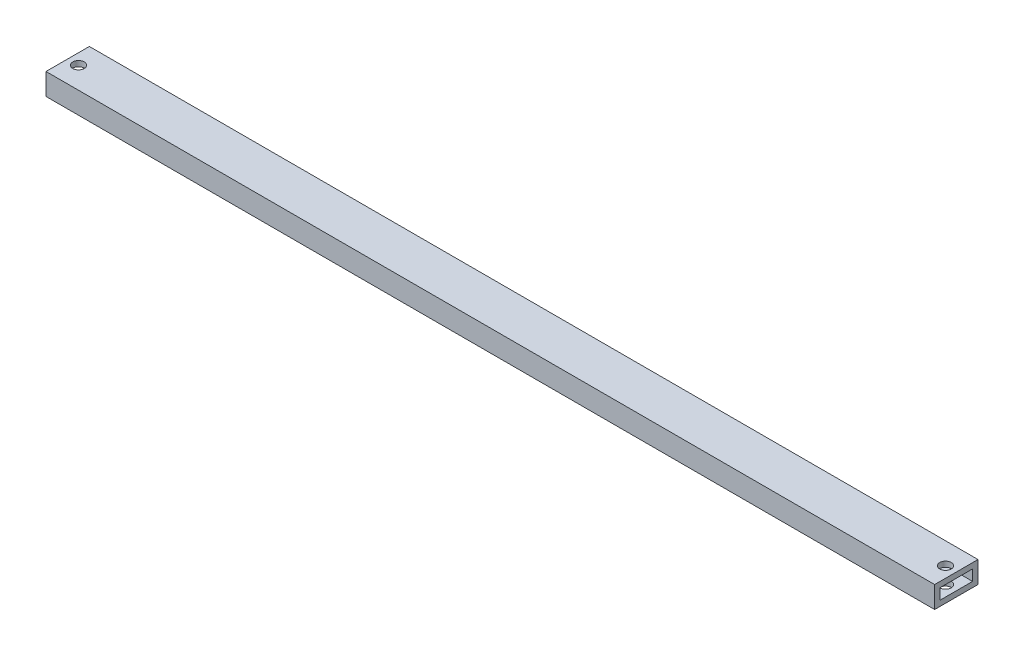
ISO-10303-21;
HEADER;
FILE_DESCRIPTION(('STEP AP214'),'2;1');
FILE_NAME('part.step','',(''),(''),'','','');
FILE_SCHEMA(('AUTOMOTIVE_DESIGN { 1 0 10303 214 1 1 1 1 }'));
ENDSEC;
DATA;
#1=APPLICATION_CONTEXT('core data for automotive mechanical design processes');
#2=APPLICATION_PROTOCOL_DEFINITION('international standard','automotive_design',2000,#1);
#3=PRODUCT_CONTEXT('',#1,'mechanical');
#4=PRODUCT('Part','Part','',(#3));
#5=PRODUCT_RELATED_PRODUCT_CATEGORY('part','',(#4));
#6=PRODUCT_DEFINITION_FORMATION('','',#4);
#7=PRODUCT_DEFINITION_CONTEXT('part definition',#1,'design');
#8=PRODUCT_DEFINITION('design','',#6,#7);
#9=PRODUCT_DEFINITION_SHAPE('','',#8);
#10=(LENGTH_UNIT() NAMED_UNIT(*) SI_UNIT(.MILLI.,.METRE.));
#11=(NAMED_UNIT(*) PLANE_ANGLE_UNIT() SI_UNIT($,.RADIAN.));
#12=(NAMED_UNIT(*) SI_UNIT($,.STERADIAN.) SOLID_ANGLE_UNIT());
#13=UNCERTAINTY_MEASURE_WITH_UNIT(LENGTH_MEASURE(1.E-05),#10,'distance_accuracy_value','');
#14=(GEOMETRIC_REPRESENTATION_CONTEXT(3) GLOBAL_UNCERTAINTY_ASSIGNED_CONTEXT((#13)) GLOBAL_UNIT_ASSIGNED_CONTEXT((#10,
#11,#12)) REPRESENTATION_CONTEXT('',''));
#15=CARTESIAN_POINT('',(0.,0.,0.));
#16=DIRECTION('',(0.,0.,1.));
#17=DIRECTION('',(1.,0.,0.));
#18=AXIS2_PLACEMENT_3D('',#15,#16,#17);
#19=CARTESIAN_POINT('',(520.7,0.,0.));
#20=DIRECTION('',(-1.,0.,0.));
#21=DIRECTION('',(0.,0.,1.));
#22=AXIS2_PLACEMENT_3D('',#19,#20,#21);
#23=PLANE('',#22);
#24=DIRECTION('',(0.,-1.,0.));
#25=VECTOR('',#24,1.);
#26=CARTESIAN_POINT('',(520.7,0.,0.));
#27=LINE('',#26,#25);
#28=CARTESIAN_POINT('',(520.7,12.7,0.));
#29=VERTEX_POINT('',#28);
#30=CARTESIAN_POINT('',(520.7,0.,0.));
#31=VERTEX_POINT('',#30);
#32=EDGE_CURVE('E160',#29,#31,#27,.T.);
#33=ORIENTED_EDGE('',*,*,#32,.T.);
#34=DIRECTION('',(0.,0.,-1.));
#35=VECTOR('',#34,1.);
#36=CARTESIAN_POINT('',(520.7,0.,0.));
#37=LINE('',#36,#35);
#38=CARTESIAN_POINT('',(520.7,0.,-25.4));
#39=VERTEX_POINT('',#38);
#40=EDGE_CURVE('E164',#31,#39,#37,.T.);
#41=ORIENTED_EDGE('',*,*,#40,.T.);
#42=DIRECTION('',(0.,1.,0.));
#43=VECTOR('',#42,1.);
#44=CARTESIAN_POINT('',(520.7,0.,-25.4));
#45=LINE('',#44,#43);
#46=CARTESIAN_POINT('',(520.7,12.7,-25.4));
#47=VERTEX_POINT('',#46);
#48=EDGE_CURVE('E168',#39,#47,#45,.T.);
#49=ORIENTED_EDGE('',*,*,#48,.T.);
#50=DIRECTION('',(0.,0.,1.));
#51=VECTOR('',#50,1.);
#52=CARTESIAN_POINT('',(520.7,12.7,0.));
#53=LINE('',#52,#51);
#54=EDGE_CURVE('E171',#47,#29,#53,.T.);
#55=ORIENTED_EDGE('',*,*,#54,.T.);
#56=EDGE_LOOP('',(#33,#41,#49,#55));
#57=FACE_BOUND('',#56,.T.);
#58=DIRECTION('',(0.,-1.,0.));
#59=VECTOR('',#58,1.);
#60=CARTESIAN_POINT('',(520.7,3.175,-3.175));
#61=LINE('',#60,#59);
#62=CARTESIAN_POINT('',(520.7,9.525,-3.175));
#63=VERTEX_POINT('',#62);
#64=CARTESIAN_POINT('',(520.7,3.175,-3.175));
#65=VERTEX_POINT('',#64);
#66=EDGE_CURVE('E114',#63,#65,#61,.T.);
#67=ORIENTED_EDGE('',*,*,#66,.F.);
#68=DIRECTION('',(0.,0.,1.));
#69=VECTOR('',#68,1.);
#70=CARTESIAN_POINT('',(520.7,9.525,-3.175));
#71=LINE('',#70,#69);
#72=CARTESIAN_POINT('',(520.7,9.525,-22.225));
#73=VERTEX_POINT('',#72);
#74=EDGE_CURVE('E141',#73,#63,#71,.T.);
#75=ORIENTED_EDGE('',*,*,#74,.F.);
#76=DIRECTION('',(0.,1.,0.));
#77=VECTOR('',#76,1.);
#78=CARTESIAN_POINT('',(520.7,3.175,-22.225));
#79=LINE('',#78,#77);
#80=CARTESIAN_POINT('',(520.7,3.175,-22.225));
#81=VERTEX_POINT('',#80);
#82=EDGE_CURVE('E136',#81,#73,#79,.T.);
#83=ORIENTED_EDGE('',*,*,#82,.F.);
#84=DIRECTION('',(0.,0.,-1.));
#85=VECTOR('',#84,1.);
#86=CARTESIAN_POINT('',(520.7,3.175,-3.175));
#87=LINE('',#86,#85);
#88=EDGE_CURVE('E123',#65,#81,#87,.T.);
#89=ORIENTED_EDGE('',*,*,#88,.F.);
#90=EDGE_LOOP('',(#67,#75,#83,#89));
#91=FACE_BOUND('',#90,.T.);
#92=ADVANCED_FACE('F38',(#57,#91),#23,.F.);
#93=CARTESIAN_POINT('',(0.,0.,0.));
#94=DIRECTION('',(-1.,0.,0.));
#95=DIRECTION('',(0.,0.,1.));
#96=AXIS2_PLACEMENT_3D('',#93,#94,#95);
#97=PLANE('',#96);
#98=DIRECTION('',(0.,-1.,0.));
#99=VECTOR('',#98,1.);
#100=CARTESIAN_POINT('',(0.,0.,0.));
#101=LINE('',#100,#99);
#102=CARTESIAN_POINT('',(0.,12.7,0.));
#103=VERTEX_POINT('',#102);
#104=CARTESIAN_POINT('',(0.,0.,0.));
#105=VERTEX_POINT('',#104);
#106=EDGE_CURVE('E132',#103,#105,#101,.T.);
#107=ORIENTED_EDGE('',*,*,#106,.F.);
#108=DIRECTION('',(0.,0.,1.));
#109=VECTOR('',#108,1.);
#110=CARTESIAN_POINT('',(0.,12.7,0.));
#111=LINE('',#110,#109);
#112=CARTESIAN_POINT('',(0.,12.7,-25.4));
#113=VERTEX_POINT('',#112);
#114=EDGE_CURVE('E165',#113,#103,#111,.T.);
#115=ORIENTED_EDGE('',*,*,#114,.F.);
#116=DIRECTION('',(0.,1.,0.));
#117=VECTOR('',#116,1.);
#118=CARTESIAN_POINT('',(0.,0.,-25.4));
#119=LINE('',#118,#117);
#120=CARTESIAN_POINT('',(0.,0.,-25.4));
#121=VERTEX_POINT('',#120);
#122=EDGE_CURVE('E179',#121,#113,#119,.T.);
#123=ORIENTED_EDGE('',*,*,#122,.F.);
#124=DIRECTION('',(0.,0.,-1.));
#125=VECTOR('',#124,1.);
#126=CARTESIAN_POINT('',(0.,0.,0.));
#127=LINE('',#126,#125);
#128=EDGE_CURVE('E177',#105,#121,#127,.T.);
#129=ORIENTED_EDGE('',*,*,#128,.F.);
#130=EDGE_LOOP('',(#107,#115,#123,#129));
#131=FACE_BOUND('',#130,.T.);
#132=DIRECTION('',(0.,0.,1.));
#133=VECTOR('',#132,1.);
#134=CARTESIAN_POINT('',(0.,9.525,-3.175));
#135=LINE('',#134,#133);
#136=CARTESIAN_POINT('',(0.,9.525,-22.225));
#137=VERTEX_POINT('',#136);
#138=CARTESIAN_POINT('',(0.,9.525,-3.175));
#139=VERTEX_POINT('',#138);
#140=EDGE_CURVE('E124',#137,#139,#135,.T.);
#141=ORIENTED_EDGE('',*,*,#140,.T.);
#142=DIRECTION('',(0.,-1.,0.));
#143=VECTOR('',#142,1.);
#144=CARTESIAN_POINT('',(0.,3.175,-3.175));
#145=LINE('',#144,#143);
#146=CARTESIAN_POINT('',(0.,3.175,-3.175));
#147=VERTEX_POINT('',#146);
#148=EDGE_CURVE('E67',#139,#147,#145,.T.);
#149=ORIENTED_EDGE('',*,*,#148,.T.);
#150=DIRECTION('',(0.,0.,-1.));
#151=VECTOR('',#150,1.);
#152=CARTESIAN_POINT('',(0.,3.175,-3.175));
#153=LINE('',#152,#151);
#154=CARTESIAN_POINT('',(0.,3.175,-22.225));
#155=VERTEX_POINT('',#154);
#156=EDGE_CURVE('E130',#147,#155,#153,.T.);
#157=ORIENTED_EDGE('',*,*,#156,.T.);
#158=DIRECTION('',(0.,1.,0.));
#159=VECTOR('',#158,1.);
#160=CARTESIAN_POINT('',(0.,3.175,-22.225));
#161=LINE('',#160,#159);
#162=EDGE_CURVE('E150',#155,#137,#161,.T.);
#163=ORIENTED_EDGE('',*,*,#162,.T.);
#164=EDGE_LOOP('',(#141,#149,#157,#163));
#165=FACE_BOUND('',#164,.T.);
#166=ADVANCED_FACE('F233',(#131,#165),#97,.T.);
#167=CARTESIAN_POINT('',(520.7,0.,0.));
#168=DIRECTION('',(0.,0.,-1.));
#169=DIRECTION('',(-1.,0.,0.));
#170=AXIS2_PLACEMENT_3D('',#167,#168,#169);
#171=PLANE('',#170);
#172=ORIENTED_EDGE('',*,*,#106,.T.);
#173=DIRECTION('',(-1.,0.,0.));
#174=VECTOR('',#173,1.);
#175=CARTESIAN_POINT('',(520.7,0.,0.));
#176=LINE('',#175,#174);
#177=EDGE_CURVE('E11',#31,#105,#176,.T.);
#178=ORIENTED_EDGE('',*,*,#177,.F.);
#179=ORIENTED_EDGE('',*,*,#32,.F.);
#180=DIRECTION('',(-1.,0.,0.));
#181=VECTOR('',#180,1.);
#182=CARTESIAN_POINT('',(520.7,12.7,0.));
#183=LINE('',#182,#181);
#184=EDGE_CURVE('E174',#29,#103,#183,.T.);
#185=ORIENTED_EDGE('',*,*,#184,.T.);
#186=EDGE_LOOP('',(#172,#178,#179,#185));
#187=FACE_BOUND('',#186,.T.);
#188=ADVANCED_FACE('F40',(#187),#171,.F.);
#189=CARTESIAN_POINT('',(520.7,0.,0.));
#190=DIRECTION('',(0.,1.,0.));
#191=DIRECTION('',(0.,0.,1.));
#192=AXIS2_PLACEMENT_3D('',#189,#190,#191);
#193=PLANE('',#192);
#194=CARTESIAN_POINT('',(514.35,0.,-12.7));
#195=DIRECTION('',(0.,1.,0.));
#196=DIRECTION('',(0.,0.,1.));
#197=AXIS2_PLACEMENT_3D('',#194,#195,#196);
#198=CIRCLE('',#197,3.35280000000005);
#199=CARTESIAN_POINT('',(514.35,0.,-9.34719999999995));
#200=VERTEX_POINT('',#199);
#201=EDGE_CURVE('E194',#200,#200,#198,.T.);
#202=ORIENTED_EDGE('',*,*,#201,.T.);
#203=EDGE_LOOP('',(#202));
#204=FACE_BOUND('',#203,.T.);
#205=CARTESIAN_POINT('',(6.34999999999997,0.,-12.7));
#206=DIRECTION('',(0.,1.,0.));
#207=DIRECTION('',(0.,0.,1.));
#208=AXIS2_PLACEMENT_3D('',#205,#206,#207);
#209=CIRCLE('',#208,3.3528);
#210=CARTESIAN_POINT('',(6.34999999999997,0.,-9.3472));
#211=VERTEX_POINT('',#210);
#212=EDGE_CURVE('E207',#211,#211,#209,.T.);
#213=ORIENTED_EDGE('',*,*,#212,.T.);
#214=EDGE_LOOP('',(#213));
#215=FACE_BOUND('',#214,.T.);
#216=ORIENTED_EDGE('',*,*,#128,.T.);
#217=DIRECTION('',(-1.,0.,0.));
#218=VECTOR('',#217,1.);
#219=CARTESIAN_POINT('',(520.7,0.,-25.4));
#220=LINE('',#219,#218);
#221=EDGE_CURVE('E48',#39,#121,#220,.T.);
#222=ORIENTED_EDGE('',*,*,#221,.F.);
#223=ORIENTED_EDGE('',*,*,#40,.F.);
#224=ORIENTED_EDGE('',*,*,#177,.T.);
#225=EDGE_LOOP('',(#216,#222,#223,#224));
#226=FACE_BOUND('',#225,.T.);
#227=ADVANCED_FACE('F258',(#204,#215,#226),#193,.F.);
#228=CARTESIAN_POINT('',(520.7,0.,-25.4));
#229=DIRECTION('',(0.,0.,1.));
#230=DIRECTION('',(1.,0.,0.));
#231=AXIS2_PLACEMENT_3D('',#228,#229,#230);
#232=PLANE('',#231);
#233=ORIENTED_EDGE('',*,*,#122,.T.);
#234=DIRECTION('',(-1.,0.,0.));
#235=VECTOR('',#234,1.);
#236=CARTESIAN_POINT('',(520.7,12.7,-25.4));
#237=LINE('',#236,#235);
#238=EDGE_CURVE('E185',#47,#113,#237,.T.);
#239=ORIENTED_EDGE('',*,*,#238,.F.);
#240=ORIENTED_EDGE('',*,*,#48,.F.);
#241=ORIENTED_EDGE('',*,*,#221,.T.);
#242=EDGE_LOOP('',(#233,#239,#240,#241));
#243=FACE_BOUND('',#242,.T.);
#244=ADVANCED_FACE('F255',(#243),#232,.F.);
#245=CARTESIAN_POINT('',(520.7,12.7,0.));
#246=DIRECTION('',(0.,-1.,0.));
#247=DIRECTION('',(0.,0.,-1.));
#248=AXIS2_PLACEMENT_3D('',#245,#246,#247);
#249=PLANE('',#248);
#250=CARTESIAN_POINT('',(514.35,12.7,-12.7));
#251=DIRECTION('',(0.,1.,0.));
#252=DIRECTION('',(0.,0.,1.));
#253=AXIS2_PLACEMENT_3D('',#250,#251,#252);
#254=CIRCLE('',#253,3.35280000000005);
#255=CARTESIAN_POINT('',(514.35,12.7,-9.34719999999995));
#256=VERTEX_POINT('',#255);
#257=EDGE_CURVE('E201',#256,#256,#254,.T.);
#258=ORIENTED_EDGE('',*,*,#257,.F.);
#259=EDGE_LOOP('',(#258));
#260=FACE_BOUND('',#259,.T.);
#261=CARTESIAN_POINT('',(6.34999999999997,12.7,-12.7));
#262=DIRECTION('',(0.,1.,0.));
#263=DIRECTION('',(0.,0.,1.));
#264=AXIS2_PLACEMENT_3D('',#261,#262,#263);
#265=CIRCLE('',#264,3.3528);
#266=CARTESIAN_POINT('',(6.34999999999997,12.7,-9.3472));
#267=VERTEX_POINT('',#266);
#268=EDGE_CURVE('E212',#267,#267,#265,.T.);
#269=ORIENTED_EDGE('',*,*,#268,.F.);
#270=EDGE_LOOP('',(#269));
#271=FACE_BOUND('',#270,.T.);
#272=ORIENTED_EDGE('',*,*,#114,.T.);
#273=ORIENTED_EDGE('',*,*,#184,.F.);
#274=ORIENTED_EDGE('',*,*,#54,.F.);
#275=ORIENTED_EDGE('',*,*,#238,.T.);
#276=EDGE_LOOP('',(#272,#273,#274,#275));
#277=FACE_BOUND('',#276,.T.);
#278=ADVANCED_FACE('F252',(#260,#271,#277),#249,.F.);
#279=CARTESIAN_POINT('',(520.7,3.175,-3.175));
#280=DIRECTION('',(0.,0.,-1.));
#281=DIRECTION('',(-1.,0.,0.));
#282=AXIS2_PLACEMENT_3D('',#279,#280,#281);
#283=PLANE('',#282);
#284=ORIENTED_EDGE('',*,*,#148,.F.);
#285=DIRECTION('',(-1.,0.,0.));
#286=VECTOR('',#285,1.);
#287=CARTESIAN_POINT('',(520.7,9.525,-3.175));
#288=LINE('',#287,#286);
#289=EDGE_CURVE('E118',#63,#139,#288,.T.);
#290=ORIENTED_EDGE('',*,*,#289,.F.);
#291=ORIENTED_EDGE('',*,*,#66,.T.);
#292=DIRECTION('',(-1.,0.,0.));
#293=VECTOR('',#292,1.);
#294=CARTESIAN_POINT('',(520.7,3.175,-3.175));
#295=LINE('',#294,#293);
#296=EDGE_CURVE('E117',#65,#147,#295,.T.);
#297=ORIENTED_EDGE('',*,*,#296,.T.);
#298=EDGE_LOOP('',(#284,#290,#291,#297));
#299=FACE_BOUND('',#298,.T.);
#300=ADVANCED_FACE('F116',(#299),#283,.T.);
#301=CARTESIAN_POINT('',(520.7,3.175,-3.175));
#302=DIRECTION('',(0.,1.,0.));
#303=DIRECTION('',(0.,0.,1.));
#304=AXIS2_PLACEMENT_3D('',#301,#302,#303);
#305=PLANE('',#304);
#306=CARTESIAN_POINT('',(514.35,3.175,-12.7));
#307=DIRECTION('',(0.,1.,0.));
#308=DIRECTION('',(0.,0.,1.));
#309=AXIS2_PLACEMENT_3D('',#306,#307,#308);
#310=CIRCLE('',#309,3.35280000000005);
#311=CARTESIAN_POINT('',(514.35,3.175,-9.34719999999995));
#312=VERTEX_POINT('',#311);
#313=EDGE_CURVE('E148',#312,#312,#310,.T.);
#314=ORIENTED_EDGE('',*,*,#313,.F.);
#315=EDGE_LOOP('',(#314));
#316=FACE_BOUND('',#315,.T.);
#317=CARTESIAN_POINT('',(6.34999999999997,3.175,-12.7));
#318=DIRECTION('',(0.,1.,0.));
#319=DIRECTION('',(0.,0.,1.));
#320=AXIS2_PLACEMENT_3D('',#317,#318,#319);
#321=CIRCLE('',#320,3.3528);
#322=CARTESIAN_POINT('',(6.34999999999997,3.175,-9.3472));
#323=VERTEX_POINT('',#322);
#324=EDGE_CURVE('E193',#323,#323,#321,.T.);
#325=ORIENTED_EDGE('',*,*,#324,.F.);
#326=EDGE_LOOP('',(#325));
#327=FACE_BOUND('',#326,.T.);
#328=ORIENTED_EDGE('',*,*,#156,.F.);
#329=ORIENTED_EDGE('',*,*,#296,.F.);
#330=ORIENTED_EDGE('',*,*,#88,.T.);
#331=DIRECTION('',(-1.,0.,0.));
#332=VECTOR('',#331,1.);
#333=CARTESIAN_POINT('',(520.7,3.175,-22.225));
#334=LINE('',#333,#332);
#335=EDGE_CURVE('E133',#81,#155,#334,.T.);
#336=ORIENTED_EDGE('',*,*,#335,.T.);
#337=EDGE_LOOP('',(#328,#329,#330,#336));
#338=FACE_BOUND('',#337,.T.);
#339=ADVANCED_FACE('F127',(#316,#327,#338),#305,.T.);
#340=CARTESIAN_POINT('',(520.7,3.175,-22.225));
#341=DIRECTION('',(0.,0.,1.));
#342=DIRECTION('',(1.,0.,0.));
#343=AXIS2_PLACEMENT_3D('',#340,#341,#342);
#344=PLANE('',#343);
#345=ORIENTED_EDGE('',*,*,#162,.F.);
#346=ORIENTED_EDGE('',*,*,#335,.F.);
#347=ORIENTED_EDGE('',*,*,#82,.T.);
#348=DIRECTION('',(-1.,0.,0.));
#349=VECTOR('',#348,1.);
#350=CARTESIAN_POINT('',(520.7,9.525,-22.225));
#351=LINE('',#350,#349);
#352=EDGE_CURVE('E59',#73,#137,#351,.T.);
#353=ORIENTED_EDGE('',*,*,#352,.T.);
#354=EDGE_LOOP('',(#345,#346,#347,#353));
#355=FACE_BOUND('',#354,.T.);
#356=ADVANCED_FACE('F229',(#355),#344,.T.);
#357=CARTESIAN_POINT('',(520.7,9.525,-3.175));
#358=DIRECTION('',(0.,-1.,0.));
#359=DIRECTION('',(0.,0.,-1.));
#360=AXIS2_PLACEMENT_3D('',#357,#358,#359);
#361=PLANE('',#360);
#362=CARTESIAN_POINT('',(514.35,9.525,-12.7));
#363=DIRECTION('',(0.,-1.,0.));
#364=DIRECTION('',(0.,0.,-1.));
#365=AXIS2_PLACEMENT_3D('',#362,#363,#364);
#366=CIRCLE('',#365,3.35280000000005);
#367=CARTESIAN_POINT('',(514.35,9.525,-16.0528));
#368=VERTEX_POINT('',#367);
#369=EDGE_CURVE('E42',#368,#368,#366,.T.);
#370=ORIENTED_EDGE('',*,*,#369,.F.);
#371=EDGE_LOOP('',(#370));
#372=FACE_BOUND('',#371,.T.);
#373=CARTESIAN_POINT('',(6.34999999999997,9.525,-12.7));
#374=DIRECTION('',(0.,-1.,0.));
#375=DIRECTION('',(0.,0.,-1.));
#376=AXIS2_PLACEMENT_3D('',#373,#374,#375);
#377=CIRCLE('',#376,3.3528);
#378=CARTESIAN_POINT('',(6.34999999999997,9.525,-16.0528));
#379=VERTEX_POINT('',#378);
#380=EDGE_CURVE('E191',#379,#379,#377,.T.);
#381=ORIENTED_EDGE('',*,*,#380,.F.);
#382=EDGE_LOOP('',(#381));
#383=FACE_BOUND('',#382,.T.);
#384=ORIENTED_EDGE('',*,*,#140,.F.);
#385=ORIENTED_EDGE('',*,*,#352,.F.);
#386=ORIENTED_EDGE('',*,*,#74,.T.);
#387=ORIENTED_EDGE('',*,*,#289,.T.);
#388=EDGE_LOOP('',(#384,#385,#386,#387));
#389=FACE_BOUND('',#388,.T.);
#390=ADVANCED_FACE('F225',(#372,#383,#389),#361,.T.);
#391=CARTESIAN_POINT('',(6.34999999999997,0.,-12.7));
#392=DIRECTION('',(0.,1.,0.));
#393=DIRECTION('',(0.,0.,1.));
#394=AXIS2_PLACEMENT_3D('',#391,#392,#393);
#395=CYLINDRICAL_SURFACE('',#394,3.3528);
#396=ORIENTED_EDGE('',*,*,#380,.T.);
#397=EDGE_LOOP('',(#396));
#398=FACE_BOUND('',#397,.T.);
#399=ORIENTED_EDGE('',*,*,#268,.T.);
#400=EDGE_LOOP('',(#399));
#401=FACE_BOUND('',#400,.T.);
#402=ADVANCED_FACE('F228',(#398,#401),#395,.F.);
#403=CARTESIAN_POINT('',(514.35,0.,-12.7));
#404=DIRECTION('',(0.,1.,0.));
#405=DIRECTION('',(0.,0.,1.));
#406=AXIS2_PLACEMENT_3D('',#403,#404,#405);
#407=CYLINDRICAL_SURFACE('',#406,3.35280000000005);
#408=ORIENTED_EDGE('',*,*,#369,.T.);
#409=EDGE_LOOP('',(#408));
#410=FACE_BOUND('',#409,.T.);
#411=ORIENTED_EDGE('',*,*,#257,.T.);
#412=EDGE_LOOP('',(#411));
#413=FACE_BOUND('',#412,.T.);
#414=ADVANCED_FACE('F222',(#410,#413),#407,.F.);
#415=ORIENTED_EDGE('',*,*,#324,.T.);
#416=EDGE_LOOP('',(#415));
#417=FACE_BOUND('',#416,.T.);
#418=ORIENTED_EDGE('',*,*,#212,.F.);
#419=EDGE_LOOP('',(#418));
#420=FACE_BOUND('',#419,.T.);
#421=ADVANCED_FACE('F280',(#417,#420),#395,.F.);
#422=ORIENTED_EDGE('',*,*,#313,.T.);
#423=EDGE_LOOP('',(#422));
#424=FACE_BOUND('',#423,.T.);
#425=ORIENTED_EDGE('',*,*,#201,.F.);
#426=EDGE_LOOP('',(#425));
#427=FACE_BOUND('',#426,.T.);
#428=ADVANCED_FACE('F282',(#424,#427),#407,.F.);
#429=CLOSED_SHELL('',(#92,#166,#188,#227,#244,#278,#300,#339,#356,#390,#402,#414,#421,#428));
#430=MANIFOLD_SOLID_BREP('B2',#429);
#431=ADVANCED_BREP_SHAPE_REPRESENTATION('',(#18,#430),#14);
#432=SHAPE_DEFINITION_REPRESENTATION(#9,#431);
ENDSEC;
END-ISO-10303-21;
